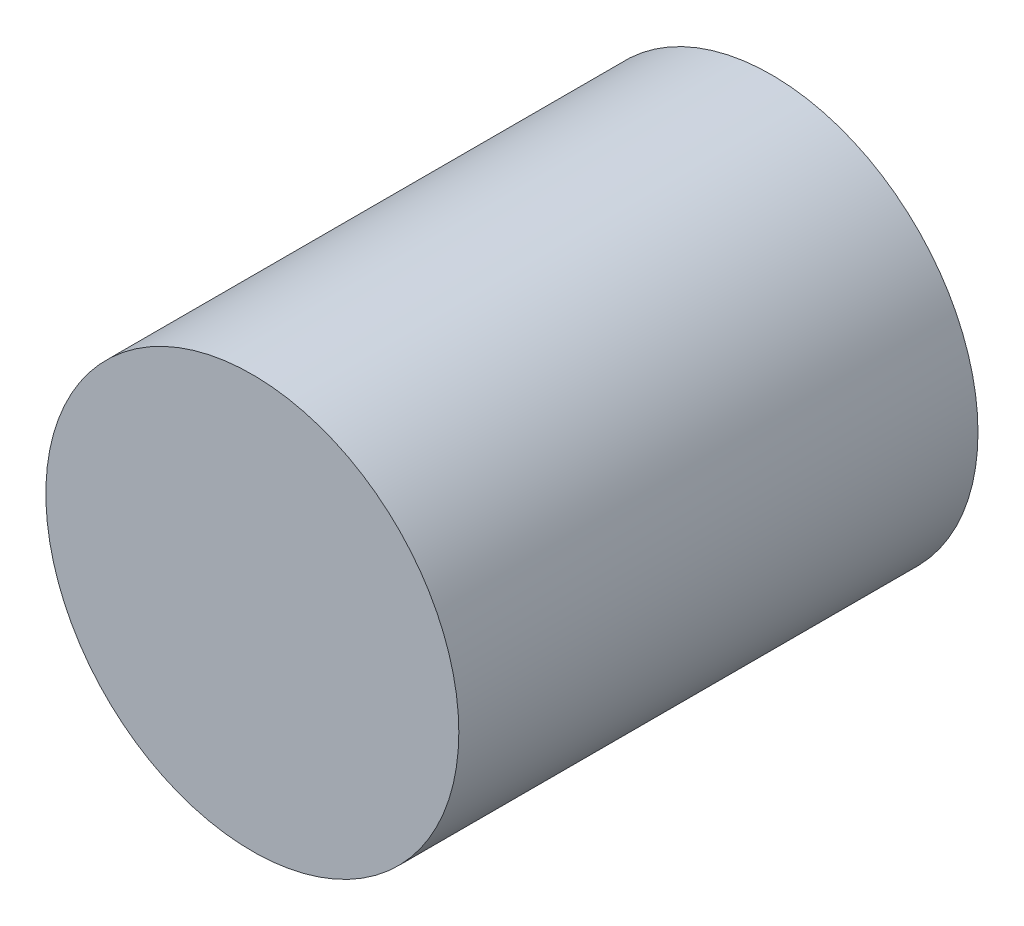
ISO-10303-21;
HEADER;
FILE_DESCRIPTION(('STEP AP214'),'2;1');
FILE_NAME('part.step','',(''),(''),'','','');
FILE_SCHEMA(('AUTOMOTIVE_DESIGN { 1 0 10303 214 1 1 1 1 }'));
ENDSEC;
DATA;
#1=APPLICATION_CONTEXT('core data for automotive mechanical design processes');
#2=APPLICATION_PROTOCOL_DEFINITION('international standard','automotive_design',2000,#1);
#3=PRODUCT_CONTEXT('',#1,'mechanical');
#4=PRODUCT('Part','Part','',(#3));
#5=PRODUCT_RELATED_PRODUCT_CATEGORY('part','',(#4));
#6=PRODUCT_DEFINITION_FORMATION('','',#4);
#7=PRODUCT_DEFINITION_CONTEXT('part definition',#1,'design');
#8=PRODUCT_DEFINITION('design','',#6,#7);
#9=PRODUCT_DEFINITION_SHAPE('','',#8);
#10=(LENGTH_UNIT() NAMED_UNIT(*) SI_UNIT(.MILLI.,.METRE.));
#11=(NAMED_UNIT(*) PLANE_ANGLE_UNIT() SI_UNIT($,.RADIAN.));
#12=(NAMED_UNIT(*) SI_UNIT($,.STERADIAN.) SOLID_ANGLE_UNIT());
#13=UNCERTAINTY_MEASURE_WITH_UNIT(LENGTH_MEASURE(1.E-05),#10,'distance_accuracy_value','');
#14=(GEOMETRIC_REPRESENTATION_CONTEXT(3) GLOBAL_UNCERTAINTY_ASSIGNED_CONTEXT((#13)) GLOBAL_UNIT_ASSIGNED_CONTEXT((#10,
#11,#12)) REPRESENTATION_CONTEXT('',''));
#15=CARTESIAN_POINT('',(0.,0.,0.));
#16=DIRECTION('',(0.,0.,1.));
#17=DIRECTION('',(1.,0.,0.));
#18=AXIS2_PLACEMENT_3D('',#15,#16,#17);
#19=CARTESIAN_POINT('',(0.,0.,44.));
#20=DIRECTION('',(0.,0.,-1.));
#21=DIRECTION('',(-1.,0.,0.));
#22=AXIS2_PLACEMENT_3D('',#19,#20,#21);
#23=CYLINDRICAL_SURFACE('',#22,17.5);
#24=CARTESIAN_POINT('',(0.,0.,44.));
#25=DIRECTION('',(0.,0.,1.));
#26=DIRECTION('',(1.,0.,0.));
#27=AXIS2_PLACEMENT_3D('',#24,#25,#26);
#28=CIRCLE('',#27,17.5);
#29=CARTESIAN_POINT('',(17.5,0.,44.));
#30=VERTEX_POINT('',#29);
#31=EDGE_CURVE('E10',#30,#30,#28,.T.);
#32=ORIENTED_EDGE('',*,*,#31,.F.);
#33=EDGE_LOOP('',(#32));
#34=FACE_BOUND('',#33,.T.);
#35=CARTESIAN_POINT('',(0.,0.,0.));
#36=DIRECTION('',(0.,0.,1.));
#37=DIRECTION('',(1.,0.,0.));
#38=AXIS2_PLACEMENT_3D('',#35,#36,#37);
#39=CIRCLE('',#38,17.5);
#40=CARTESIAN_POINT('',(17.5,0.,0.));
#41=VERTEX_POINT('',#40);
#42=EDGE_CURVE('E34',#41,#41,#39,.T.);
#43=ORIENTED_EDGE('',*,*,#42,.T.);
#44=EDGE_LOOP('',(#43));
#45=FACE_BOUND('',#44,.T.);
#46=ADVANCED_FACE('F31',(#34,#45),#23,.T.);
#47=CARTESIAN_POINT('',(0.,0.,44.));
#48=DIRECTION('',(0.,0.,1.));
#49=DIRECTION('',(1.,0.,0.));
#50=AXIS2_PLACEMENT_3D('',#47,#48,#49);
#51=PLANE('',#50);
#52=ORIENTED_EDGE('',*,*,#31,.T.);
#53=EDGE_LOOP('',(#52));
#54=FACE_BOUND('',#53,.T.);
#55=ADVANCED_FACE('F46',(#54),#51,.T.);
#56=CARTESIAN_POINT('',(0.,0.,0.));
#57=DIRECTION('',(0.,0.,1.));
#58=DIRECTION('',(1.,0.,0.));
#59=AXIS2_PLACEMENT_3D('',#56,#57,#58);
#60=PLANE('',#59);
#61=ORIENTED_EDGE('',*,*,#42,.F.);
#62=EDGE_LOOP('',(#61));
#63=FACE_BOUND('',#62,.T.);
#64=ADVANCED_FACE('F44',(#63),#60,.F.);
#65=CLOSED_SHELL('',(#46,#55,#64));
#66=MANIFOLD_SOLID_BREP('B2',#65);
#67=ADVANCED_BREP_SHAPE_REPRESENTATION('',(#18,#66),#14);
#68=SHAPE_DEFINITION_REPRESENTATION(#9,#67);
ENDSEC;
END-ISO-10303-21;
